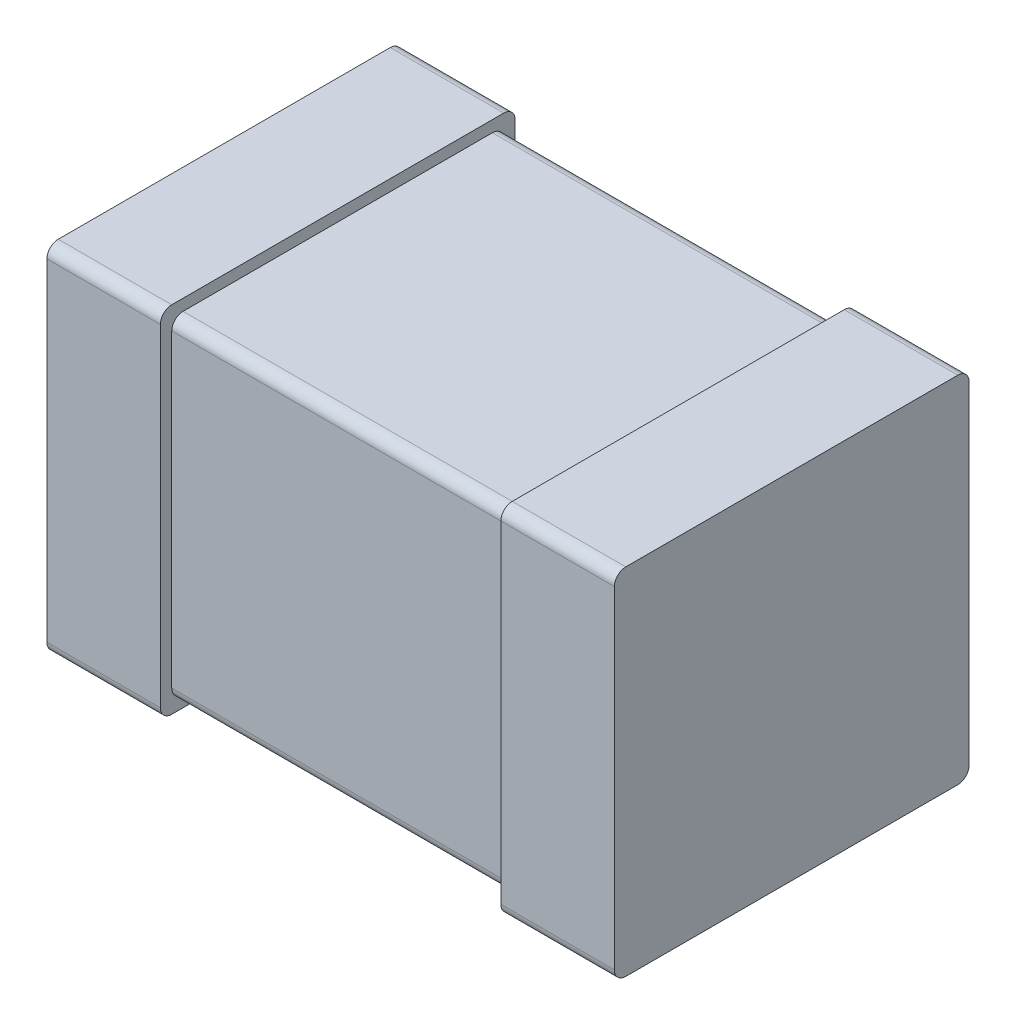
ISO-10303-21;
HEADER;
FILE_DESCRIPTION(('STEP AP214'),'2;1');
FILE_NAME('part.step','',(''),(''),'','','');
FILE_SCHEMA(('AUTOMOTIVE_DESIGN { 1 0 10303 214 1 1 1 1 }'));
ENDSEC;
DATA;
#1=APPLICATION_CONTEXT('core data for automotive mechanical design processes');
#2=APPLICATION_PROTOCOL_DEFINITION('international standard','automotive_design',2000,#1);
#3=PRODUCT_CONTEXT('',#1,'mechanical');
#4=PRODUCT('Part','Part','',(#3));
#5=PRODUCT_RELATED_PRODUCT_CATEGORY('part','',(#4));
#6=PRODUCT_DEFINITION_FORMATION('','',#4);
#7=PRODUCT_DEFINITION_CONTEXT('part definition',#1,'design');
#8=PRODUCT_DEFINITION('design','',#6,#7);
#9=PRODUCT_DEFINITION_SHAPE('','',#8);
#10=(LENGTH_UNIT() NAMED_UNIT(*) SI_UNIT(.MILLI.,.METRE.));
#11=(NAMED_UNIT(*) PLANE_ANGLE_UNIT() SI_UNIT($,.RADIAN.));
#12=(NAMED_UNIT(*) SI_UNIT($,.STERADIAN.) SOLID_ANGLE_UNIT());
#13=UNCERTAINTY_MEASURE_WITH_UNIT(LENGTH_MEASURE(1.E-05),#10,'distance_accuracy_value','');
#14=(GEOMETRIC_REPRESENTATION_CONTEXT(3) GLOBAL_UNCERTAINTY_ASSIGNED_CONTEXT((#13)) GLOBAL_UNIT_ASSIGNED_CONTEXT((#10,
#11,#12)) REPRESENTATION_CONTEXT('',''));
#15=CARTESIAN_POINT('',(0.,0.,0.));
#16=DIRECTION('',(0.,0.,1.));
#17=DIRECTION('',(1.,0.,0.));
#18=AXIS2_PLACEMENT_3D('',#15,#16,#17);
#19=CARTESIAN_POINT('',(1.,-0.625,0.));
#20=DIRECTION('',(1.,0.,0.));
#21=DIRECTION('',(0.,1.,0.));
#22=AXIS2_PLACEMENT_3D('',#19,#20,#21);
#23=PLANE('',#22);
#24=DIRECTION('',(0.,0.,1.));
#25=VECTOR('',#24,1.);
#26=CARTESIAN_POINT('',(1.,-0.625,0.));
#27=LINE('',#26,#25);
#28=CARTESIAN_POINT('',(1.,-0.625,0.04));
#29=VERTEX_POINT('',#28);
#30=CARTESIAN_POINT('',(1.,-0.625,1.21));
#31=VERTEX_POINT('',#30);
#32=EDGE_CURVE('E346',#29,#31,#27,.T.);
#33=ORIENTED_EDGE('',*,*,#32,.F.);
#34=CARTESIAN_POINT('',(1.,-0.585,0.04));
#35=DIRECTION('',(1.,0.,0.));
#36=DIRECTION('',(0.,0.,1.));
#37=AXIS2_PLACEMENT_3D('',#34,#35,#36);
#38=CIRCLE('',#37,0.04);
#39=CARTESIAN_POINT('',(1.,-0.585,0.));
#40=VERTEX_POINT('',#39);
#41=EDGE_CURVE('E357',#29,#40,#38,.T.);
#42=ORIENTED_EDGE('',*,*,#41,.T.);
#43=DIRECTION('',(0.,1.,0.));
#44=VECTOR('',#43,1.);
#45=CARTESIAN_POINT('',(1.,-0.625,0.));
#46=LINE('',#45,#44);
#47=CARTESIAN_POINT('',(1.,0.585,0.));
#48=VERTEX_POINT('',#47);
#49=EDGE_CURVE('E344',#40,#48,#46,.T.);
#50=ORIENTED_EDGE('',*,*,#49,.T.);
#51=CARTESIAN_POINT('',(1.,0.585,0.04));
#52=DIRECTION('',(-1.,0.,0.));
#53=DIRECTION('',(0.,0.,1.));
#54=AXIS2_PLACEMENT_3D('',#51,#52,#53);
#55=CIRCLE('',#54,0.04);
#56=CARTESIAN_POINT('',(1.,0.625,0.04));
#57=VERTEX_POINT('',#56);
#58=EDGE_CURVE('E314',#57,#48,#55,.T.);
#59=ORIENTED_EDGE('',*,*,#58,.F.);
#60=DIRECTION('',(0.,0.,1.));
#61=VECTOR('',#60,1.);
#62=CARTESIAN_POINT('',(1.,0.625,0.));
#63=LINE('',#62,#61);
#64=CARTESIAN_POINT('',(1.,0.625,1.21));
#65=VERTEX_POINT('',#64);
#66=EDGE_CURVE('E11',#57,#65,#63,.T.);
#67=ORIENTED_EDGE('',*,*,#66,.T.);
#68=CARTESIAN_POINT('',(1.,0.585,1.21));
#69=DIRECTION('',(1.,0.,0.));
#70=DIRECTION('',(0.,0.,1.));
#71=AXIS2_PLACEMENT_3D('',#68,#69,#70);
#72=CIRCLE('',#71,0.04);
#73=CARTESIAN_POINT('',(1.,0.585,1.25));
#74=VERTEX_POINT('',#73);
#75=EDGE_CURVE('E317',#65,#74,#72,.T.);
#76=ORIENTED_EDGE('',*,*,#75,.T.);
#77=DIRECTION('',(0.,1.,0.));
#78=VECTOR('',#77,1.);
#79=CARTESIAN_POINT('',(1.,-0.625,1.25));
#80=LINE('',#79,#78);
#81=CARTESIAN_POINT('',(1.,-0.585,1.25));
#82=VERTEX_POINT('',#81);
#83=EDGE_CURVE('E494',#82,#74,#80,.T.);
#84=ORIENTED_EDGE('',*,*,#83,.F.);
#85=CARTESIAN_POINT('',(1.,-0.585,1.21));
#86=DIRECTION('',(-1.,0.,0.));
#87=DIRECTION('',(0.,0.,1.));
#88=AXIS2_PLACEMENT_3D('',#85,#86,#87);
#89=CIRCLE('',#88,0.04);
#90=EDGE_CURVE('E404',#31,#82,#89,.T.);
#91=ORIENTED_EDGE('',*,*,#90,.F.);
#92=EDGE_LOOP('',(#33,#42,#50,#59,#67,#76,#84,#91));
#93=FACE_BOUND('',#92,.T.);
#94=ADVANCED_FACE('F17',(#93),#23,.T.);
#95=CARTESIAN_POINT('',(0.6,0.625,0.));
#96=DIRECTION('',(0.,1.,0.));
#97=DIRECTION('',(1.,0.,0.));
#98=AXIS2_PLACEMENT_3D('',#95,#96,#97);
#99=PLANE('',#98);
#100=ORIENTED_EDGE('',*,*,#66,.F.);
#101=DIRECTION('',(1.,0.,0.));
#102=VECTOR('',#101,1.);
#103=CARTESIAN_POINT('',(0.6,0.625,0.04));
#104=LINE('',#103,#102);
#105=CARTESIAN_POINT('',(0.6,0.625,0.04));
#106=VERTEX_POINT('',#105);
#107=EDGE_CURVE('E318',#106,#57,#104,.T.);
#108=ORIENTED_EDGE('',*,*,#107,.F.);
#109=DIRECTION('',(0.,0.,1.));
#110=VECTOR('',#109,1.);
#111=CARTESIAN_POINT('',(0.6,0.625,0.));
#112=LINE('',#111,#110);
#113=CARTESIAN_POINT('',(0.6,0.625,1.21));
#114=VERTEX_POINT('',#113);
#115=EDGE_CURVE('E467',#106,#114,#112,.T.);
#116=ORIENTED_EDGE('',*,*,#115,.T.);
#117=DIRECTION('',(1.,0.,0.));
#118=VECTOR('',#117,1.);
#119=CARTESIAN_POINT('',(0.6,0.625,1.21));
#120=LINE('',#119,#118);
#121=EDGE_CURVE('E25',#114,#65,#120,.T.);
#122=ORIENTED_EDGE('',*,*,#121,.T.);
#123=EDGE_LOOP('',(#100,#108,#116,#122));
#124=FACE_BOUND('',#123,.T.);
#125=ADVANCED_FACE('F509',(#124),#99,.T.);
#126=CARTESIAN_POINT('',(0.6,0.585,1.21));
#127=DIRECTION('',(1.,0.,0.));
#128=DIRECTION('',(0.,1.,0.));
#129=AXIS2_PLACEMENT_3D('',#126,#127,#128);
#130=CYLINDRICAL_SURFACE('',#129,0.04);
#131=CARTESIAN_POINT('',(0.6,0.585,1.21));
#132=DIRECTION('',(1.,0.,0.));
#133=DIRECTION('',(0.,0.,1.));
#134=AXIS2_PLACEMENT_3D('',#131,#132,#133);
#135=CIRCLE('',#134,0.04);
#136=CARTESIAN_POINT('',(0.6,0.585,1.25));
#137=VERTEX_POINT('',#136);
#138=EDGE_CURVE('E463',#114,#137,#135,.T.);
#139=ORIENTED_EDGE('',*,*,#138,.T.);
#140=DIRECTION('',(1.,0.,0.));
#141=VECTOR('',#140,1.);
#142=CARTESIAN_POINT('',(0.6,0.585,1.25));
#143=LINE('',#142,#141);
#144=EDGE_CURVE('E498',#137,#74,#143,.T.);
#145=ORIENTED_EDGE('',*,*,#144,.T.);
#146=ORIENTED_EDGE('',*,*,#75,.F.);
#147=ORIENTED_EDGE('',*,*,#121,.F.);
#148=EDGE_LOOP('',(#139,#145,#146,#147));
#149=FACE_BOUND('',#148,.T.);
#150=ADVANCED_FACE('F513',(#149),#130,.T.);
#151=CARTESIAN_POINT('',(0.6,0.585,0.04));
#152=DIRECTION('',(1.,0.,0.));
#153=DIRECTION('',(0.,1.,0.));
#154=AXIS2_PLACEMENT_3D('',#151,#152,#153);
#155=CYLINDRICAL_SURFACE('',#154,0.04);
#156=ORIENTED_EDGE('',*,*,#107,.T.);
#157=ORIENTED_EDGE('',*,*,#58,.T.);
#158=DIRECTION('',(1.,0.,0.));
#159=VECTOR('',#158,1.);
#160=CARTESIAN_POINT('',(0.6,0.585,0.));
#161=LINE('',#160,#159);
#162=CARTESIAN_POINT('',(0.6,0.585,0.));
#163=VERTEX_POINT('',#162);
#164=EDGE_CURVE('E340',#163,#48,#161,.T.);
#165=ORIENTED_EDGE('',*,*,#164,.F.);
#166=CARTESIAN_POINT('',(0.6,0.585,0.04));
#167=DIRECTION('',(-1.,0.,0.));
#168=DIRECTION('',(0.,0.,1.));
#169=AXIS2_PLACEMENT_3D('',#166,#167,#168);
#170=CIRCLE('',#169,0.04);
#171=EDGE_CURVE('E471',#106,#163,#170,.T.);
#172=ORIENTED_EDGE('',*,*,#171,.F.);
#173=EDGE_LOOP('',(#156,#157,#165,#172));
#174=FACE_BOUND('',#173,.T.);
#175=ADVANCED_FACE('F534',(#174),#155,.T.);
#176=CARTESIAN_POINT('',(0.6,-0.625,1.25));
#177=DIRECTION('',(0.,0.,1.));
#178=DIRECTION('',(1.,0.,0.));
#179=AXIS2_PLACEMENT_3D('',#176,#177,#178);
#180=PLANE('',#179);
#181=DIRECTION('',(0.,1.,0.));
#182=VECTOR('',#181,1.);
#183=CARTESIAN_POINT('',(0.6,-0.625,1.25));
#184=LINE('',#183,#182);
#185=CARTESIAN_POINT('',(0.6,-0.585,1.25));
#186=VERTEX_POINT('',#185);
#187=EDGE_CURVE('E298',#186,#137,#184,.T.);
#188=ORIENTED_EDGE('',*,*,#187,.F.);
#189=DIRECTION('',(1.,0.,0.));
#190=VECTOR('',#189,1.);
#191=CARTESIAN_POINT('',(0.6,-0.585,1.25));
#192=LINE('',#191,#190);
#193=EDGE_CURVE('E345',#186,#82,#192,.T.);
#194=ORIENTED_EDGE('',*,*,#193,.T.);
#195=ORIENTED_EDGE('',*,*,#83,.T.);
#196=ORIENTED_EDGE('',*,*,#144,.F.);
#197=EDGE_LOOP('',(#188,#194,#195,#196));
#198=FACE_BOUND('',#197,.T.);
#199=ADVANCED_FACE('F517',(#198),#180,.T.);
#200=CARTESIAN_POINT('',(0.6,-0.625,0.));
#201=DIRECTION('',(0.,0.,1.));
#202=DIRECTION('',(1.,0.,0.));
#203=AXIS2_PLACEMENT_3D('',#200,#201,#202);
#204=PLANE('',#203);
#205=ORIENTED_EDGE('',*,*,#164,.T.);
#206=ORIENTED_EDGE('',*,*,#49,.F.);
#207=DIRECTION('',(1.,0.,0.));
#208=VECTOR('',#207,1.);
#209=CARTESIAN_POINT('',(0.6,-0.585,0.));
#210=LINE('',#209,#208);
#211=CARTESIAN_POINT('',(0.6,-0.585,0.));
#212=VERTEX_POINT('',#211);
#213=EDGE_CURVE('E350',#212,#40,#210,.T.);
#214=ORIENTED_EDGE('',*,*,#213,.F.);
#215=DIRECTION('',(0.,1.,0.));
#216=VECTOR('',#215,1.);
#217=CARTESIAN_POINT('',(0.6,-0.625,0.));
#218=LINE('',#217,#216);
#219=EDGE_CURVE('E475',#212,#163,#218,.T.);
#220=ORIENTED_EDGE('',*,*,#219,.T.);
#221=EDGE_LOOP('',(#205,#206,#214,#220));
#222=FACE_BOUND('',#221,.T.);
#223=ADVANCED_FACE('F531',(#222),#204,.F.);
#224=CARTESIAN_POINT('',(0.6,-0.585,1.21));
#225=DIRECTION('',(1.,0.,0.));
#226=DIRECTION('',(0.,-1.,0.));
#227=AXIS2_PLACEMENT_3D('',#224,#225,#226);
#228=CYLINDRICAL_SURFACE('',#227,0.04);
#229=DIRECTION('',(1.,0.,0.));
#230=VECTOR('',#229,1.);
#231=CARTESIAN_POINT('',(0.6,-0.625,1.21));
#232=LINE('',#231,#230);
#233=CARTESIAN_POINT('',(0.6,-0.625,1.21));
#234=VERTEX_POINT('',#233);
#235=EDGE_CURVE('E335',#234,#31,#232,.T.);
#236=ORIENTED_EDGE('',*,*,#235,.T.);
#237=ORIENTED_EDGE('',*,*,#90,.T.);
#238=ORIENTED_EDGE('',*,*,#193,.F.);
#239=CARTESIAN_POINT('',(0.6,-0.585,1.21));
#240=DIRECTION('',(-1.,0.,0.));
#241=DIRECTION('',(0.,0.,1.));
#242=AXIS2_PLACEMENT_3D('',#239,#240,#241);
#243=CIRCLE('',#242,0.04);
#244=EDGE_CURVE('E294',#234,#186,#243,.T.);
#245=ORIENTED_EDGE('',*,*,#244,.F.);
#246=EDGE_LOOP('',(#236,#237,#238,#245));
#247=FACE_BOUND('',#246,.T.);
#248=ADVANCED_FACE('F520',(#247),#228,.T.);
#249=CARTESIAN_POINT('',(0.6,-0.585,0.04));
#250=DIRECTION('',(1.,0.,0.));
#251=DIRECTION('',(0.,-1.,0.));
#252=AXIS2_PLACEMENT_3D('',#249,#250,#251);
#253=CYLINDRICAL_SURFACE('',#252,0.04);
#254=CARTESIAN_POINT('',(0.6,-0.585,0.04));
#255=DIRECTION('',(1.,0.,0.));
#256=DIRECTION('',(0.,0.,1.));
#257=AXIS2_PLACEMENT_3D('',#254,#255,#256);
#258=CIRCLE('',#257,0.04);
#259=CARTESIAN_POINT('',(0.6,-0.625,0.04));
#260=VERTEX_POINT('',#259);
#261=EDGE_CURVE('E336',#260,#212,#258,.T.);
#262=ORIENTED_EDGE('',*,*,#261,.T.);
#263=ORIENTED_EDGE('',*,*,#213,.T.);
#264=ORIENTED_EDGE('',*,*,#41,.F.);
#265=DIRECTION('',(1.,0.,0.));
#266=VECTOR('',#265,1.);
#267=CARTESIAN_POINT('',(0.6,-0.625,0.04));
#268=LINE('',#267,#266);
#269=EDGE_CURVE('E351',#260,#29,#268,.T.);
#270=ORIENTED_EDGE('',*,*,#269,.F.);
#271=EDGE_LOOP('',(#262,#263,#264,#270));
#272=FACE_BOUND('',#271,.T.);
#273=ADVANCED_FACE('F529',(#272),#253,.T.);
#274=CARTESIAN_POINT('',(0.6,-0.625,0.));
#275=DIRECTION('',(0.,1.,0.));
#276=DIRECTION('',(1.,0.,0.));
#277=AXIS2_PLACEMENT_3D('',#274,#275,#276);
#278=PLANE('',#277);
#279=ORIENTED_EDGE('',*,*,#235,.F.);
#280=DIRECTION('',(0.,0.,1.));
#281=VECTOR('',#280,1.);
#282=CARTESIAN_POINT('',(0.6,-0.625,0.));
#283=LINE('',#282,#281);
#284=EDGE_CURVE('E331',#260,#234,#283,.T.);
#285=ORIENTED_EDGE('',*,*,#284,.F.);
#286=ORIENTED_EDGE('',*,*,#269,.T.);
#287=ORIENTED_EDGE('',*,*,#32,.T.);
#288=EDGE_LOOP('',(#279,#285,#286,#287));
#289=FACE_BOUND('',#288,.T.);
#290=ADVANCED_FACE('F523',(#289),#278,.F.);
#291=CARTESIAN_POINT('',(0.6,-0.625,0.));
#292=DIRECTION('',(1.,0.,0.));
#293=DIRECTION('',(0.,1.,0.));
#294=AXIS2_PLACEMENT_3D('',#291,#292,#293);
#295=PLANE('',#294);
#296=DIRECTION('',(0.,1.,0.));
#297=VECTOR('',#296,1.);
#298=CARTESIAN_POINT('',(0.6,-0.585,0.04));
#299=LINE('',#298,#297);
#300=CARTESIAN_POINT('',(0.6,-0.545,0.04));
#301=VERTEX_POINT('',#300);
#302=CARTESIAN_POINT('',(0.6,0.545,0.04));
#303=VERTEX_POINT('',#302);
#304=EDGE_CURVE('E365',#301,#303,#299,.T.);
#305=ORIENTED_EDGE('',*,*,#304,.T.);
#306=CARTESIAN_POINT('',(0.6,0.545,0.08));
#307=DIRECTION('',(-1.,0.,0.));
#308=DIRECTION('',(0.,0.,1.));
#309=AXIS2_PLACEMENT_3D('',#306,#307,#308);
#310=CIRCLE('',#309,0.04);
#311=CARTESIAN_POINT('',(0.6,0.585,0.08));
#312=VERTEX_POINT('',#311);
#313=EDGE_CURVE('E309',#312,#303,#310,.T.);
#314=ORIENTED_EDGE('',*,*,#313,.F.);
#315=DIRECTION('',(0.,0.,1.));
#316=VECTOR('',#315,1.);
#317=CARTESIAN_POINT('',(0.6,0.585,0.04));
#318=LINE('',#317,#316);
#319=CARTESIAN_POINT('',(0.6,0.585,1.17));
#320=VERTEX_POINT('',#319);
#321=EDGE_CURVE('E305',#312,#320,#318,.T.);
#322=ORIENTED_EDGE('',*,*,#321,.T.);
#323=CARTESIAN_POINT('',(0.6,0.545,1.17));
#324=DIRECTION('',(1.,0.,0.));
#325=DIRECTION('',(0.,0.,1.));
#326=AXIS2_PLACEMENT_3D('',#323,#324,#325);
#327=CIRCLE('',#326,0.04);
#328=CARTESIAN_POINT('',(0.6,0.545,1.21));
#329=VERTEX_POINT('',#328);
#330=EDGE_CURVE('E280',#320,#329,#327,.T.);
#331=ORIENTED_EDGE('',*,*,#330,.T.);
#332=DIRECTION('',(0.,1.,0.));
#333=VECTOR('',#332,1.);
#334=CARTESIAN_POINT('',(0.6,-0.585,1.21));
#335=LINE('',#334,#333);
#336=CARTESIAN_POINT('',(0.6,-0.545,1.21));
#337=VERTEX_POINT('',#336);
#338=EDGE_CURVE('E279',#337,#329,#335,.T.);
#339=ORIENTED_EDGE('',*,*,#338,.F.);
#340=CARTESIAN_POINT('',(0.6,-0.545,1.17));
#341=DIRECTION('',(-1.,0.,0.));
#342=DIRECTION('',(0.,0.,1.));
#343=AXIS2_PLACEMENT_3D('',#340,#341,#342);
#344=CIRCLE('',#343,0.04);
#345=CARTESIAN_POINT('',(0.6,-0.585,1.17));
#346=VERTEX_POINT('',#345);
#347=EDGE_CURVE('E428',#346,#337,#344,.T.);
#348=ORIENTED_EDGE('',*,*,#347,.F.);
#349=DIRECTION('',(0.,0.,1.));
#350=VECTOR('',#349,1.);
#351=CARTESIAN_POINT('',(0.6,-0.585,0.04));
#352=LINE('',#351,#350);
#353=CARTESIAN_POINT('',(0.6,-0.585,0.08));
#354=VERTEX_POINT('',#353);
#355=EDGE_CURVE('E299',#354,#346,#352,.T.);
#356=ORIENTED_EDGE('',*,*,#355,.F.);
#357=CARTESIAN_POINT('',(0.6,-0.545,0.08));
#358=DIRECTION('',(1.,0.,0.));
#359=DIRECTION('',(0.,0.,1.));
#360=AXIS2_PLACEMENT_3D('',#357,#358,#359);
#361=CIRCLE('',#360,0.04);
#362=EDGE_CURVE('E266',#354,#301,#361,.T.);
#363=ORIENTED_EDGE('',*,*,#362,.T.);
#364=EDGE_LOOP('',(#305,#314,#322,#331,#339,#348,#356,#363));
#365=FACE_BOUND('',#364,.T.);
#366=ORIENTED_EDGE('',*,*,#244,.T.);
#367=ORIENTED_EDGE('',*,*,#187,.T.);
#368=ORIENTED_EDGE('',*,*,#138,.F.);
#369=ORIENTED_EDGE('',*,*,#115,.F.);
#370=ORIENTED_EDGE('',*,*,#171,.T.);
#371=ORIENTED_EDGE('',*,*,#219,.F.);
#372=ORIENTED_EDGE('',*,*,#261,.F.);
#373=ORIENTED_EDGE('',*,*,#284,.T.);
#374=EDGE_LOOP('',(#366,#367,#368,#369,#370,#371,#372,#373));
#375=FACE_BOUND('',#374,.T.);
#376=ADVANCED_FACE('F526',(#365,#375),#295,.F.);
#377=CARTESIAN_POINT('',(-0.6,-0.585,0.04));
#378=DIRECTION('',(0.,1.,0.));
#379=DIRECTION('',(1.,0.,0.));
#380=AXIS2_PLACEMENT_3D('',#377,#378,#379);
#381=PLANE('',#380);
#382=DIRECTION('',(1.,0.,0.));
#383=VECTOR('',#382,1.);
#384=CARTESIAN_POINT('',(-0.6,-0.585,1.17));
#385=LINE('',#384,#383);
#386=CARTESIAN_POINT('',(-0.6,-0.585,1.17));
#387=VERTEX_POINT('',#386);
#388=EDGE_CURVE('E424',#387,#346,#385,.T.);
#389=ORIENTED_EDGE('',*,*,#388,.F.);
#390=DIRECTION('',(0.,0.,1.));
#391=VECTOR('',#390,1.);
#392=CARTESIAN_POINT('',(-0.6,-0.585,0.04));
#393=LINE('',#392,#391);
#394=CARTESIAN_POINT('',(-0.6,-0.585,0.08));
#395=VERTEX_POINT('',#394);
#396=EDGE_CURVE('E399',#395,#387,#393,.T.);
#397=ORIENTED_EDGE('',*,*,#396,.F.);
#398=DIRECTION('',(1.,0.,0.));
#399=VECTOR('',#398,1.);
#400=CARTESIAN_POINT('',(-0.6,-0.585,0.08));
#401=LINE('',#400,#399);
#402=EDGE_CURVE('E438',#395,#354,#401,.T.);
#403=ORIENTED_EDGE('',*,*,#402,.T.);
#404=ORIENTED_EDGE('',*,*,#355,.T.);
#405=EDGE_LOOP('',(#389,#397,#403,#404));
#406=FACE_BOUND('',#405,.T.);
#407=ADVANCED_FACE('F619',(#406),#381,.F.);
#408=CARTESIAN_POINT('',(-0.6,-0.545,1.17));
#409=DIRECTION('',(1.,0.,0.));
#410=DIRECTION('',(0.,-1.,0.));
#411=AXIS2_PLACEMENT_3D('',#408,#409,#410);
#412=CYLINDRICAL_SURFACE('',#411,0.04);
#413=ORIENTED_EDGE('',*,*,#388,.T.);
#414=ORIENTED_EDGE('',*,*,#347,.T.);
#415=DIRECTION('',(1.,0.,0.));
#416=VECTOR('',#415,1.);
#417=CARTESIAN_POINT('',(-0.6,-0.545,1.21));
#418=LINE('',#417,#416);
#419=CARTESIAN_POINT('',(-0.6,-0.545,1.21));
#420=VERTEX_POINT('',#419);
#421=EDGE_CURVE('E275',#420,#337,#418,.T.);
#422=ORIENTED_EDGE('',*,*,#421,.F.);
#423=CARTESIAN_POINT('',(-0.6,-0.545,1.17));
#424=DIRECTION('',(-1.,0.,0.));
#425=DIRECTION('',(0.,0.,1.));
#426=AXIS2_PLACEMENT_3D('',#423,#424,#425);
#427=CIRCLE('',#426,0.04);
#428=EDGE_CURVE('E403',#387,#420,#427,.T.);
#429=ORIENTED_EDGE('',*,*,#428,.F.);
#430=EDGE_LOOP('',(#413,#414,#422,#429));
#431=FACE_BOUND('',#430,.T.);
#432=ADVANCED_FACE('F631',(#431),#412,.T.);
#433=CARTESIAN_POINT('',(-0.6,-0.585,1.21));
#434=DIRECTION('',(0.,0.,1.));
#435=DIRECTION('',(1.,0.,0.));
#436=AXIS2_PLACEMENT_3D('',#433,#434,#435);
#437=PLANE('',#436);
#438=DIRECTION('',(0.,1.,0.));
#439=VECTOR('',#438,1.);
#440=CARTESIAN_POINT('',(-0.6,-0.585,1.21));
#441=LINE('',#440,#439);
#442=CARTESIAN_POINT('',(-0.6,0.545,1.21));
#443=VERTEX_POINT('',#442);
#444=EDGE_CURVE('E411',#420,#443,#441,.T.);
#445=ORIENTED_EDGE('',*,*,#444,.F.);
#446=ORIENTED_EDGE('',*,*,#421,.T.);
#447=ORIENTED_EDGE('',*,*,#338,.T.);
#448=DIRECTION('',(1.,0.,0.));
#449=VECTOR('',#448,1.);
#450=CARTESIAN_POINT('',(-0.6,0.545,1.21));
#451=LINE('',#450,#449);
#452=EDGE_CURVE('E304',#443,#329,#451,.T.);
#453=ORIENTED_EDGE('',*,*,#452,.F.);
#454=EDGE_LOOP('',(#445,#446,#447,#453));
#455=FACE_BOUND('',#454,.T.);
#456=ADVANCED_FACE('F644',(#455),#437,.T.);
#457=CARTESIAN_POINT('',(-0.6,0.545,1.17));
#458=DIRECTION('',(1.,0.,0.));
#459=DIRECTION('',(0.,1.,0.));
#460=AXIS2_PLACEMENT_3D('',#457,#458,#459);
#461=CYLINDRICAL_SURFACE('',#460,0.04);
#462=CARTESIAN_POINT('',(-0.6,0.545,1.17));
#463=DIRECTION('',(1.,0.,0.));
#464=DIRECTION('',(0.,0.,1.));
#465=AXIS2_PLACEMENT_3D('',#462,#463,#464);
#466=CIRCLE('',#465,0.04);
#467=CARTESIAN_POINT('',(-0.6,0.585,1.17));
#468=VERTEX_POINT('',#467);
#469=EDGE_CURVE('E415',#468,#443,#466,.T.);
#470=ORIENTED_EDGE('',*,*,#469,.T.);
#471=ORIENTED_EDGE('',*,*,#452,.T.);
#472=ORIENTED_EDGE('',*,*,#330,.F.);
#473=DIRECTION('',(1.,0.,0.));
#474=VECTOR('',#473,1.);
#475=CARTESIAN_POINT('',(-0.6,0.585,1.17));
#476=LINE('',#475,#474);
#477=EDGE_CURVE('E300',#468,#320,#476,.T.);
#478=ORIENTED_EDGE('',*,*,#477,.F.);
#479=EDGE_LOOP('',(#470,#471,#472,#478));
#480=FACE_BOUND('',#479,.T.);
#481=ADVANCED_FACE('F656',(#480),#461,.T.);
#482=CARTESIAN_POINT('',(-0.6,0.585,0.04));
#483=DIRECTION('',(0.,1.,0.));
#484=DIRECTION('',(1.,0.,0.));
#485=AXIS2_PLACEMENT_3D('',#482,#483,#484);
#486=PLANE('',#485);
#487=ORIENTED_EDGE('',*,*,#321,.F.);
#488=DIRECTION('',(1.,0.,0.));
#489=VECTOR('',#488,1.);
#490=CARTESIAN_POINT('',(-0.6,0.585,0.08));
#491=LINE('',#490,#489);
#492=CARTESIAN_POINT('',(-0.6,0.585,0.08));
#493=VERTEX_POINT('',#492);
#494=EDGE_CURVE('E361',#493,#312,#491,.T.);
#495=ORIENTED_EDGE('',*,*,#494,.F.);
#496=DIRECTION('',(0.,0.,1.));
#497=VECTOR('',#496,1.);
#498=CARTESIAN_POINT('',(-0.6,0.585,0.04));
#499=LINE('',#498,#497);
#500=EDGE_CURVE('E419',#493,#468,#499,.T.);
#501=ORIENTED_EDGE('',*,*,#500,.T.);
#502=ORIENTED_EDGE('',*,*,#477,.T.);
#503=EDGE_LOOP('',(#487,#495,#501,#502));
#504=FACE_BOUND('',#503,.T.);
#505=ADVANCED_FACE('F668',(#504),#486,.T.);
#506=CARTESIAN_POINT('',(-0.6,0.545,0.08));
#507=DIRECTION('',(1.,0.,0.));
#508=DIRECTION('',(0.,1.,0.));
#509=AXIS2_PLACEMENT_3D('',#506,#507,#508);
#510=CYLINDRICAL_SURFACE('',#509,0.04);
#511=ORIENTED_EDGE('',*,*,#494,.T.);
#512=ORIENTED_EDGE('',*,*,#313,.T.);
#513=DIRECTION('',(1.,0.,0.));
#514=VECTOR('',#513,1.);
#515=CARTESIAN_POINT('',(-0.6,0.545,0.04));
#516=LINE('',#515,#514);
#517=CARTESIAN_POINT('',(-0.6,0.545,0.04));
#518=VERTEX_POINT('',#517);
#519=EDGE_CURVE('E442',#518,#303,#516,.T.);
#520=ORIENTED_EDGE('',*,*,#519,.F.);
#521=CARTESIAN_POINT('',(-0.6,0.545,0.08));
#522=DIRECTION('',(-1.,0.,0.));
#523=DIRECTION('',(0.,0.,1.));
#524=AXIS2_PLACEMENT_3D('',#521,#522,#523);
#525=CIRCLE('',#524,0.04);
#526=EDGE_CURVE('E423',#493,#518,#525,.T.);
#527=ORIENTED_EDGE('',*,*,#526,.F.);
#528=EDGE_LOOP('',(#511,#512,#520,#527));
#529=FACE_BOUND('',#528,.T.);
#530=ADVANCED_FACE('F681',(#529),#510,.T.);
#531=CARTESIAN_POINT('',(-0.6,-0.585,0.04));
#532=DIRECTION('',(0.,0.,1.));
#533=DIRECTION('',(1.,0.,0.));
#534=AXIS2_PLACEMENT_3D('',#531,#532,#533);
#535=PLANE('',#534);
#536=ORIENTED_EDGE('',*,*,#519,.T.);
#537=ORIENTED_EDGE('',*,*,#304,.F.);
#538=DIRECTION('',(1.,0.,0.));
#539=VECTOR('',#538,1.);
#540=CARTESIAN_POINT('',(-0.6,-0.545,0.04));
#541=LINE('',#540,#539);
#542=CARTESIAN_POINT('',(-0.6,-0.545,0.04));
#543=VERTEX_POINT('',#542);
#544=EDGE_CURVE('E264',#543,#301,#541,.T.);
#545=ORIENTED_EDGE('',*,*,#544,.F.);
#546=DIRECTION('',(0.,1.,0.));
#547=VECTOR('',#546,1.);
#548=CARTESIAN_POINT('',(-0.6,-0.585,0.04));
#549=LINE('',#548,#547);
#550=EDGE_CURVE('E267',#543,#518,#549,.T.);
#551=ORIENTED_EDGE('',*,*,#550,.T.);
#552=EDGE_LOOP('',(#536,#537,#545,#551));
#553=FACE_BOUND('',#552,.T.);
#554=ADVANCED_FACE('F694',(#553),#535,.F.);
#555=CARTESIAN_POINT('',(-0.6,-0.545,0.08));
#556=DIRECTION('',(1.,0.,0.));
#557=DIRECTION('',(0.,-1.,0.));
#558=AXIS2_PLACEMENT_3D('',#555,#556,#557);
#559=CYLINDRICAL_SURFACE('',#558,0.04);
#560=CARTESIAN_POINT('',(-0.6,-0.545,0.08));
#561=DIRECTION('',(1.,0.,0.));
#562=DIRECTION('',(0.,0.,1.));
#563=AXIS2_PLACEMENT_3D('',#560,#561,#562);
#564=CIRCLE('',#563,0.04);
#565=EDGE_CURVE('E395',#395,#543,#564,.T.);
#566=ORIENTED_EDGE('',*,*,#565,.T.);
#567=ORIENTED_EDGE('',*,*,#544,.T.);
#568=ORIENTED_EDGE('',*,*,#362,.F.);
#569=ORIENTED_EDGE('',*,*,#402,.F.);
#570=EDGE_LOOP('',(#566,#567,#568,#569));
#571=FACE_BOUND('',#570,.T.);
#572=ADVANCED_FACE('F707',(#571),#559,.T.);
#573=CARTESIAN_POINT('',(-0.6,-0.625,0.));
#574=DIRECTION('',(1.,0.,0.));
#575=DIRECTION('',(0.,1.,0.));
#576=AXIS2_PLACEMENT_3D('',#573,#574,#575);
#577=PLANE('',#576);
#578=ORIENTED_EDGE('',*,*,#565,.F.);
#579=ORIENTED_EDGE('',*,*,#396,.T.);
#580=ORIENTED_EDGE('',*,*,#428,.T.);
#581=ORIENTED_EDGE('',*,*,#444,.T.);
#582=ORIENTED_EDGE('',*,*,#469,.F.);
#583=ORIENTED_EDGE('',*,*,#500,.F.);
#584=ORIENTED_EDGE('',*,*,#526,.T.);
#585=ORIENTED_EDGE('',*,*,#550,.F.);
#586=EDGE_LOOP('',(#578,#579,#580,#581,#582,#583,#584,#585));
#587=FACE_BOUND('',#586,.T.);
#588=DIRECTION('',(0.,0.,1.));
#589=VECTOR('',#588,1.);
#590=CARTESIAN_POINT('',(-0.6,-0.625,0.));
#591=LINE('',#590,#589);
#592=CARTESIAN_POINT('',(-0.6,-0.625,0.04));
#593=VERTEX_POINT('',#592);
#594=CARTESIAN_POINT('',(-0.6,-0.625,1.21));
#595=VERTEX_POINT('',#594);
#596=EDGE_CURVE('E326',#593,#595,#591,.T.);
#597=ORIENTED_EDGE('',*,*,#596,.F.);
#598=CARTESIAN_POINT('',(-0.6,-0.585,0.04));
#599=DIRECTION('',(1.,0.,0.));
#600=DIRECTION('',(0.,0.,1.));
#601=AXIS2_PLACEMENT_3D('',#598,#599,#600);
#602=CIRCLE('',#601,0.04);
#603=CARTESIAN_POINT('',(-0.6,-0.585,0.));
#604=VERTEX_POINT('',#603);
#605=EDGE_CURVE('E271',#593,#604,#602,.T.);
#606=ORIENTED_EDGE('',*,*,#605,.T.);
#607=DIRECTION('',(0.,1.,0.));
#608=VECTOR('',#607,1.);
#609=CARTESIAN_POINT('',(-0.6,-0.625,0.));
#610=LINE('',#609,#608);
#611=CARTESIAN_POINT('',(-0.6,0.585,0.));
#612=VERTEX_POINT('',#611);
#613=EDGE_CURVE('E313',#604,#612,#610,.T.);
#614=ORIENTED_EDGE('',*,*,#613,.T.);
#615=CARTESIAN_POINT('',(-0.6,0.585,0.04));
#616=DIRECTION('',(-1.,0.,0.));
#617=DIRECTION('',(0.,0.,1.));
#618=AXIS2_PLACEMENT_3D('',#615,#616,#617);
#619=CIRCLE('',#618,0.04);
#620=CARTESIAN_POINT('',(-0.6,0.625,0.04));
#621=VERTEX_POINT('',#620);
#622=EDGE_CURVE('E285',#621,#612,#619,.T.);
#623=ORIENTED_EDGE('',*,*,#622,.F.);
#624=DIRECTION('',(0.,0.,1.));
#625=VECTOR('',#624,1.);
#626=CARTESIAN_POINT('',(-0.6,0.625,0.));
#627=LINE('',#626,#625);
#628=CARTESIAN_POINT('',(-0.6,0.625,1.21));
#629=VERTEX_POINT('',#628);
#630=EDGE_CURVE('E392',#621,#629,#627,.T.);
#631=ORIENTED_EDGE('',*,*,#630,.T.);
#632=CARTESIAN_POINT('',(-0.6,0.585,1.21));
#633=DIRECTION('',(1.,0.,0.));
#634=DIRECTION('',(0.,0.,1.));
#635=AXIS2_PLACEMENT_3D('',#632,#633,#634);
#636=CIRCLE('',#635,0.04);
#637=CARTESIAN_POINT('',(-0.6,0.585,1.25));
#638=VERTEX_POINT('',#637);
#639=EDGE_CURVE('E385',#629,#638,#636,.T.);
#640=ORIENTED_EDGE('',*,*,#639,.T.);
#641=DIRECTION('',(0.,1.,0.));
#642=VECTOR('',#641,1.);
#643=CARTESIAN_POINT('',(-0.6,-0.625,1.25));
#644=LINE('',#643,#642);
#645=CARTESIAN_POINT('',(-0.6,-0.585,1.25));
#646=VERTEX_POINT('',#645);
#647=EDGE_CURVE('E375',#646,#638,#644,.T.);
#648=ORIENTED_EDGE('',*,*,#647,.F.);
#649=CARTESIAN_POINT('',(-0.6,-0.585,1.21));
#650=DIRECTION('',(-1.,0.,0.));
#651=DIRECTION('',(0.,0.,1.));
#652=AXIS2_PLACEMENT_3D('',#649,#650,#651);
#653=CIRCLE('',#652,0.04);
#654=EDGE_CURVE('E234',#595,#646,#653,.T.);
#655=ORIENTED_EDGE('',*,*,#654,.F.);
#656=EDGE_LOOP('',(#597,#606,#614,#623,#631,#640,#648,#655));
#657=FACE_BOUND('',#656,.T.);
#658=ADVANCED_FACE('F719',(#587,#657),#577,.T.);
#659=CARTESIAN_POINT('',(-1.,0.625,0.));
#660=DIRECTION('',(0.,1.,0.));
#661=DIRECTION('',(1.,0.,0.));
#662=AXIS2_PLACEMENT_3D('',#659,#660,#661);
#663=PLANE('',#662);
#664=ORIENTED_EDGE('',*,*,#630,.F.);
#665=DIRECTION('',(1.,0.,0.));
#666=VECTOR('',#665,1.);
#667=CARTESIAN_POINT('',(-1.,0.625,0.04));
#668=LINE('',#667,#666);
#669=CARTESIAN_POINT('',(-1.,0.625,0.04));
#670=VERTEX_POINT('',#669);
#671=EDGE_CURVE('E281',#670,#621,#668,.T.);
#672=ORIENTED_EDGE('',*,*,#671,.F.);
#673=DIRECTION('',(0.,0.,1.));
#674=VECTOR('',#673,1.);
#675=CARTESIAN_POINT('',(-1.,0.625,0.));
#676=LINE('',#675,#674);
#677=CARTESIAN_POINT('',(-1.,0.625,1.21));
#678=VERTEX_POINT('',#677);
#679=EDGE_CURVE('E274',#670,#678,#676,.T.);
#680=ORIENTED_EDGE('',*,*,#679,.T.);
#681=DIRECTION('',(1.,0.,0.));
#682=VECTOR('',#681,1.);
#683=CARTESIAN_POINT('',(-1.,0.625,1.21));
#684=LINE('',#683,#682);
#685=EDGE_CURVE('E388',#678,#629,#684,.T.);
#686=ORIENTED_EDGE('',*,*,#685,.T.);
#687=EDGE_LOOP('',(#664,#672,#680,#686));
#688=FACE_BOUND('',#687,.T.);
#689=ADVANCED_FACE('F731',(#688),#663,.T.);
#690=CARTESIAN_POINT('',(-1.,0.585,1.21));
#691=DIRECTION('',(1.,0.,0.));
#692=DIRECTION('',(0.,1.,0.));
#693=AXIS2_PLACEMENT_3D('',#690,#691,#692);
#694=CYLINDRICAL_SURFACE('',#693,0.04);
#695=CARTESIAN_POINT('',(-1.,0.585,1.21));
#696=DIRECTION('',(1.,0.,0.));
#697=DIRECTION('',(0.,0.,1.));
#698=AXIS2_PLACEMENT_3D('',#695,#696,#697);
#699=CIRCLE('',#698,0.04);
#700=CARTESIAN_POINT('',(-1.,0.585,1.25));
#701=VERTEX_POINT('',#700);
#702=EDGE_CURVE('E249',#678,#701,#699,.T.);
#703=ORIENTED_EDGE('',*,*,#702,.T.);
#704=DIRECTION('',(1.,0.,0.));
#705=VECTOR('',#704,1.);
#706=CARTESIAN_POINT('',(-1.,0.585,1.25));
#707=LINE('',#706,#705);
#708=EDGE_CURVE('E244',#701,#638,#707,.T.);
#709=ORIENTED_EDGE('',*,*,#708,.T.);
#710=ORIENTED_EDGE('',*,*,#639,.F.);
#711=ORIENTED_EDGE('',*,*,#685,.F.);
#712=EDGE_LOOP('',(#703,#709,#710,#711));
#713=FACE_BOUND('',#712,.T.);
#714=ADVANCED_FACE('F742',(#713),#694,.T.);
#715=CARTESIAN_POINT('',(-1.,0.585,0.04));
#716=DIRECTION('',(1.,0.,0.));
#717=DIRECTION('',(0.,1.,0.));
#718=AXIS2_PLACEMENT_3D('',#715,#716,#717);
#719=CYLINDRICAL_SURFACE('',#718,0.04);
#720=ORIENTED_EDGE('',*,*,#671,.T.);
#721=ORIENTED_EDGE('',*,*,#622,.T.);
#722=DIRECTION('',(1.,0.,0.));
#723=VECTOR('',#722,1.);
#724=CARTESIAN_POINT('',(-1.,0.585,0.));
#725=LINE('',#724,#723);
#726=CARTESIAN_POINT('',(-1.,0.585,0.));
#727=VERTEX_POINT('',#726);
#728=EDGE_CURVE('E238',#727,#612,#725,.T.);
#729=ORIENTED_EDGE('',*,*,#728,.F.);
#730=CARTESIAN_POINT('',(-1.,0.585,0.04));
#731=DIRECTION('',(-1.,0.,0.));
#732=DIRECTION('',(0.,0.,1.));
#733=AXIS2_PLACEMENT_3D('',#730,#731,#732);
#734=CIRCLE('',#733,0.04);
#735=EDGE_CURVE('E289',#670,#727,#734,.T.);
#736=ORIENTED_EDGE('',*,*,#735,.F.);
#737=EDGE_LOOP('',(#720,#721,#729,#736));
#738=FACE_BOUND('',#737,.T.);
#739=ADVANCED_FACE('F754',(#738),#719,.T.);
#740=CARTESIAN_POINT('',(-1.,-0.625,1.25));
#741=DIRECTION('',(0.,0.,1.));
#742=DIRECTION('',(1.,0.,0.));
#743=AXIS2_PLACEMENT_3D('',#740,#741,#742);
#744=PLANE('',#743);
#745=DIRECTION('',(0.,1.,0.));
#746=VECTOR('',#745,1.);
#747=CARTESIAN_POINT('',(-1.,-0.625,1.25));
#748=LINE('',#747,#746);
#749=CARTESIAN_POINT('',(-1.,-0.585,1.25));
#750=VERTEX_POINT('',#749);
#751=EDGE_CURVE('E241',#750,#701,#748,.T.);
#752=ORIENTED_EDGE('',*,*,#751,.F.);
#753=DIRECTION('',(1.,0.,0.));
#754=VECTOR('',#753,1.);
#755=CARTESIAN_POINT('',(-1.,-0.585,1.25));
#756=LINE('',#755,#754);
#757=EDGE_CURVE('E228',#750,#646,#756,.T.);
#758=ORIENTED_EDGE('',*,*,#757,.T.);
#759=ORIENTED_EDGE('',*,*,#647,.T.);
#760=ORIENTED_EDGE('',*,*,#708,.F.);
#761=EDGE_LOOP('',(#752,#758,#759,#760));
#762=FACE_BOUND('',#761,.T.);
#763=ADVANCED_FACE('F242',(#762),#744,.T.);
#764=CARTESIAN_POINT('',(-1.,-0.625,0.));
#765=DIRECTION('',(0.,0.,1.));
#766=DIRECTION('',(1.,0.,0.));
#767=AXIS2_PLACEMENT_3D('',#764,#765,#766);
#768=PLANE('',#767);
#769=ORIENTED_EDGE('',*,*,#728,.T.);
#770=ORIENTED_EDGE('',*,*,#613,.F.);
#771=DIRECTION('',(1.,0.,0.));
#772=VECTOR('',#771,1.);
#773=CARTESIAN_POINT('',(-1.,-0.585,0.));
#774=LINE('',#773,#772);
#775=CARTESIAN_POINT('',(-1.,-0.585,0.));
#776=VERTEX_POINT('',#775);
#777=EDGE_CURVE('E330',#776,#604,#774,.T.);
#778=ORIENTED_EDGE('',*,*,#777,.F.);
#779=DIRECTION('',(0.,1.,0.));
#780=VECTOR('',#779,1.);
#781=CARTESIAN_POINT('',(-1.,-0.625,0.));
#782=LINE('',#781,#780);
#783=EDGE_CURVE('E293',#776,#727,#782,.T.);
#784=ORIENTED_EDGE('',*,*,#783,.T.);
#785=EDGE_LOOP('',(#769,#770,#778,#784));
#786=FACE_BOUND('',#785,.T.);
#787=ADVANCED_FACE('F775',(#786),#768,.F.);
#788=CARTESIAN_POINT('',(-1.,-0.585,1.21));
#789=DIRECTION('',(1.,0.,0.));
#790=DIRECTION('',(0.,-1.,0.));
#791=AXIS2_PLACEMENT_3D('',#788,#789,#790);
#792=CYLINDRICAL_SURFACE('',#791,0.04);
#793=DIRECTION('',(1.,0.,0.));
#794=VECTOR('',#793,1.);
#795=CARTESIAN_POINT('',(-1.,-0.625,1.21));
#796=LINE('',#795,#794);
#797=CARTESIAN_POINT('',(-1.,-0.625,1.21));
#798=VERTEX_POINT('',#797);
#799=EDGE_CURVE('E339',#798,#595,#796,.T.);
#800=ORIENTED_EDGE('',*,*,#799,.T.);
#801=ORIENTED_EDGE('',*,*,#654,.T.);
#802=ORIENTED_EDGE('',*,*,#757,.F.);
#803=CARTESIAN_POINT('',(-1.,-0.585,1.21));
#804=DIRECTION('',(-1.,0.,0.));
#805=DIRECTION('',(0.,0.,1.));
#806=AXIS2_PLACEMENT_3D('',#803,#804,#805);
#807=CIRCLE('',#806,0.04);
#808=EDGE_CURVE('E233',#798,#750,#807,.T.);
#809=ORIENTED_EDGE('',*,*,#808,.F.);
#810=EDGE_LOOP('',(#800,#801,#802,#809));
#811=FACE_BOUND('',#810,.T.);
#812=ADVANCED_FACE('F231',(#811),#792,.T.);
#813=CARTESIAN_POINT('',(-1.,-0.585,0.04));
#814=DIRECTION('',(1.,0.,0.));
#815=DIRECTION('',(0.,-1.,0.));
#816=AXIS2_PLACEMENT_3D('',#813,#814,#815);
#817=CYLINDRICAL_SURFACE('',#816,0.04);
#818=CARTESIAN_POINT('',(-1.,-0.585,0.04));
#819=DIRECTION('',(1.,0.,0.));
#820=DIRECTION('',(0.,0.,1.));
#821=AXIS2_PLACEMENT_3D('',#818,#819,#820);
#822=CIRCLE('',#821,0.04);
#823=CARTESIAN_POINT('',(-1.,-0.625,0.04));
#824=VERTEX_POINT('',#823);
#825=EDGE_CURVE('E322',#824,#776,#822,.T.);
#826=ORIENTED_EDGE('',*,*,#825,.T.);
#827=ORIENTED_EDGE('',*,*,#777,.T.);
#828=ORIENTED_EDGE('',*,*,#605,.F.);
#829=DIRECTION('',(1.,0.,0.));
#830=VECTOR('',#829,1.);
#831=CARTESIAN_POINT('',(-1.,-0.625,0.04));
#832=LINE('',#831,#830);
#833=EDGE_CURVE('E263',#824,#593,#832,.T.);
#834=ORIENTED_EDGE('',*,*,#833,.F.);
#835=EDGE_LOOP('',(#826,#827,#828,#834));
#836=FACE_BOUND('',#835,.T.);
#837=ADVANCED_FACE('F793',(#836),#817,.T.);
#838=CARTESIAN_POINT('',(-1.,-0.625,0.));
#839=DIRECTION('',(0.,1.,0.));
#840=DIRECTION('',(1.,0.,0.));
#841=AXIS2_PLACEMENT_3D('',#838,#839,#840);
#842=PLANE('',#841);
#843=ORIENTED_EDGE('',*,*,#799,.F.);
#844=DIRECTION('',(0.,0.,1.));
#845=VECTOR('',#844,1.);
#846=CARTESIAN_POINT('',(-1.,-0.625,0.));
#847=LINE('',#846,#845);
#848=EDGE_CURVE('E255',#824,#798,#847,.T.);
#849=ORIENTED_EDGE('',*,*,#848,.F.);
#850=ORIENTED_EDGE('',*,*,#833,.T.);
#851=ORIENTED_EDGE('',*,*,#596,.T.);
#852=EDGE_LOOP('',(#843,#849,#850,#851));
#853=FACE_BOUND('',#852,.T.);
#854=ADVANCED_FACE('F802',(#853),#842,.F.);
#855=CARTESIAN_POINT('',(-1.,-0.625,0.));
#856=DIRECTION('',(1.,0.,0.));
#857=DIRECTION('',(0.,1.,0.));
#858=AXIS2_PLACEMENT_3D('',#855,#856,#857);
#859=PLANE('',#858);
#860=ORIENTED_EDGE('',*,*,#808,.T.);
#861=ORIENTED_EDGE('',*,*,#751,.T.);
#862=ORIENTED_EDGE('',*,*,#702,.F.);
#863=ORIENTED_EDGE('',*,*,#679,.F.);
#864=ORIENTED_EDGE('',*,*,#735,.T.);
#865=ORIENTED_EDGE('',*,*,#783,.F.);
#866=ORIENTED_EDGE('',*,*,#825,.F.);
#867=ORIENTED_EDGE('',*,*,#848,.T.);
#868=EDGE_LOOP('',(#860,#861,#862,#863,#864,#865,#866,#867));
#869=FACE_BOUND('',#868,.T.);
#870=ADVANCED_FACE('F252',(#869),#859,.F.);
#871=CLOSED_SHELL('',(#94,#125,#150,#175,#199,#223,#248,#273,#290,#376,#407,#432,#456,#481,#505,
#530,#554,#572,#658,#689,#714,#739,#763,#787,#812,#837,#854,#870));
#872=MANIFOLD_SOLID_BREP('B1',#871);
#873=ADVANCED_BREP_SHAPE_REPRESENTATION('',(#18,#872),#14);
#874=SHAPE_DEFINITION_REPRESENTATION(#9,#873);
ENDSEC;
END-ISO-10303-21;
